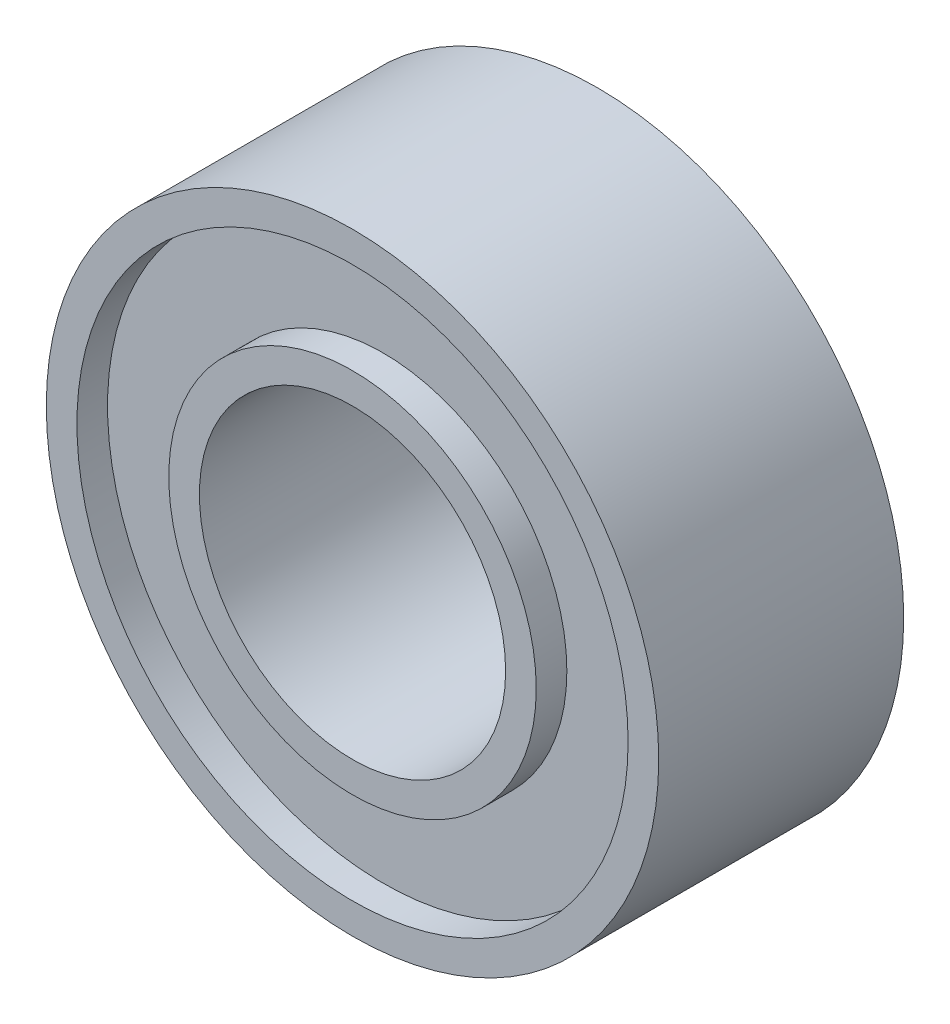
ISO-10303-21;
HEADER;
FILE_DESCRIPTION(('STEP AP214'),'2;1');
FILE_NAME('part.step','',(''),(''),'','','');
FILE_SCHEMA(('AUTOMOTIVE_DESIGN { 1 0 10303 214 1 1 1 1 }'));
ENDSEC;
DATA;
#1=APPLICATION_CONTEXT('core data for automotive mechanical design processes');
#2=APPLICATION_PROTOCOL_DEFINITION('international standard','automotive_design',2000,#1);
#3=PRODUCT_CONTEXT('',#1,'mechanical');
#4=PRODUCT('Part','Part','',(#3));
#5=PRODUCT_RELATED_PRODUCT_CATEGORY('part','',(#4));
#6=PRODUCT_DEFINITION_FORMATION('','',#4);
#7=PRODUCT_DEFINITION_CONTEXT('part definition',#1,'design');
#8=PRODUCT_DEFINITION('design','',#6,#7);
#9=PRODUCT_DEFINITION_SHAPE('','',#8);
#10=(LENGTH_UNIT() NAMED_UNIT(*) SI_UNIT(.MILLI.,.METRE.));
#11=(NAMED_UNIT(*) PLANE_ANGLE_UNIT() SI_UNIT($,.RADIAN.));
#12=(NAMED_UNIT(*) SI_UNIT($,.STERADIAN.) SOLID_ANGLE_UNIT());
#13=UNCERTAINTY_MEASURE_WITH_UNIT(LENGTH_MEASURE(1.E-05),#10,'distance_accuracy_value','');
#14=(GEOMETRIC_REPRESENTATION_CONTEXT(3) GLOBAL_UNCERTAINTY_ASSIGNED_CONTEXT((#13)) GLOBAL_UNIT_ASSIGNED_CONTEXT((#10,
#11,#12)) REPRESENTATION_CONTEXT('',''));
#15=CARTESIAN_POINT('',(0.,0.,0.));
#16=DIRECTION('',(0.,0.,1.));
#17=DIRECTION('',(1.,0.,0.));
#18=AXIS2_PLACEMENT_3D('',#15,#16,#17);
#19=CARTESIAN_POINT('',(0.,0.,0.));
#20=DIRECTION('',(0.,0.,1.));
#21=DIRECTION('',(1.,0.,0.));
#22=AXIS2_PLACEMENT_3D('',#19,#20,#21);
#23=PLANE('',#22);
#24=CARTESIAN_POINT('',(0.,0.,0.));
#25=DIRECTION('',(0.,0.,1.));
#26=DIRECTION('',(1.,0.,0.));
#27=AXIS2_PLACEMENT_3D('',#24,#25,#26);
#28=CIRCLE('',#27,2.5);
#29=CARTESIAN_POINT('',(2.5,0.,0.));
#30=VERTEX_POINT('',#29);
#31=EDGE_CURVE('E52',#30,#30,#28,.T.);
#32=ORIENTED_EDGE('',*,*,#31,.T.);
#33=EDGE_LOOP('',(#32));
#34=FACE_BOUND('',#33,.T.);
#35=CARTESIAN_POINT('',(0.,0.,0.));
#36=DIRECTION('',(0.,0.,1.));
#37=DIRECTION('',(1.,0.,0.));
#38=AXIS2_PLACEMENT_3D('',#35,#36,#37);
#39=CIRCLE('',#38,3.);
#40=CARTESIAN_POINT('',(3.,0.,0.));
#41=VERTEX_POINT('',#40);
#42=EDGE_CURVE('E84',#41,#41,#39,.T.);
#43=ORIENTED_EDGE('',*,*,#42,.F.);
#44=EDGE_LOOP('',(#43));
#45=FACE_BOUND('',#44,.T.);
#46=ADVANCED_FACE('F37',(#34,#45),#23,.F.);
#47=CARTESIAN_POINT('',(0.,0.,4.));
#48=DIRECTION('',(0.,0.,1.));
#49=DIRECTION('',(1.,0.,0.));
#50=AXIS2_PLACEMENT_3D('',#47,#48,#49);
#51=PLANE('',#50);
#52=CARTESIAN_POINT('',(0.,0.,4.));
#53=DIRECTION('',(0.,0.,1.));
#54=DIRECTION('',(1.,0.,0.));
#55=AXIS2_PLACEMENT_3D('',#52,#53,#54);
#56=CIRCLE('',#55,2.5);
#57=CARTESIAN_POINT('',(2.5,0.,4.));
#58=VERTEX_POINT('',#57);
#59=EDGE_CURVE('E50',#58,#58,#56,.T.);
#60=ORIENTED_EDGE('',*,*,#59,.F.);
#61=EDGE_LOOP('',(#60));
#62=FACE_BOUND('',#61,.T.);
#63=CARTESIAN_POINT('',(0.,0.,4.));
#64=DIRECTION('',(0.,0.,1.));
#65=DIRECTION('',(1.,0.,0.));
#66=AXIS2_PLACEMENT_3D('',#63,#64,#65);
#67=CIRCLE('',#66,3.);
#68=CARTESIAN_POINT('',(3.,0.,4.));
#69=VERTEX_POINT('',#68);
#70=EDGE_CURVE('E68',#69,#69,#67,.T.);
#71=ORIENTED_EDGE('',*,*,#70,.T.);
#72=EDGE_LOOP('',(#71));
#73=FACE_BOUND('',#72,.T.);
#74=ADVANCED_FACE('F102',(#62,#73),#51,.T.);
#75=CARTESIAN_POINT('',(0.,0.,4.));
#76=DIRECTION('',(0.,0.,1.));
#77=DIRECTION('',(1.,0.,0.));
#78=AXIS2_PLACEMENT_3D('',#75,#76,#77);
#79=CIRCLE('',#78,4.5);
#80=CARTESIAN_POINT('',(4.5,0.,4.));
#81=VERTEX_POINT('',#80);
#82=EDGE_CURVE('E60',#81,#81,#79,.T.);
#83=ORIENTED_EDGE('',*,*,#82,.F.);
#84=EDGE_LOOP('',(#83));
#85=FACE_BOUND('',#84,.T.);
#86=CARTESIAN_POINT('',(0.,0.,4.));
#87=DIRECTION('',(0.,0.,1.));
#88=DIRECTION('',(1.,0.,0.));
#89=AXIS2_PLACEMENT_3D('',#86,#87,#88);
#90=CIRCLE('',#89,5.);
#91=CARTESIAN_POINT('',(5.,0.,4.));
#92=VERTEX_POINT('',#91);
#93=EDGE_CURVE('E10',#92,#92,#90,.T.);
#94=ORIENTED_EDGE('',*,*,#93,.T.);
#95=EDGE_LOOP('',(#94));
#96=FACE_BOUND('',#95,.T.);
#97=ADVANCED_FACE('F108',(#85,#96),#51,.T.);
#98=CARTESIAN_POINT('',(0.,0.,0.));
#99=DIRECTION('',(0.,0.,1.));
#100=DIRECTION('',(1.,0.,0.));
#101=AXIS2_PLACEMENT_3D('',#98,#99,#100);
#102=CIRCLE('',#101,4.5);
#103=CARTESIAN_POINT('',(4.5,0.,0.));
#104=VERTEX_POINT('',#103);
#105=EDGE_CURVE('E76',#104,#104,#102,.T.);
#106=ORIENTED_EDGE('',*,*,#105,.T.);
#107=EDGE_LOOP('',(#106));
#108=FACE_BOUND('',#107,.T.);
#109=CARTESIAN_POINT('',(0.,0.,0.));
#110=DIRECTION('',(0.,0.,1.));
#111=DIRECTION('',(1.,0.,0.));
#112=AXIS2_PLACEMENT_3D('',#109,#110,#111);
#113=CIRCLE('',#112,5.);
#114=CARTESIAN_POINT('',(5.,0.,0.));
#115=VERTEX_POINT('',#114);
#116=EDGE_CURVE('E41',#115,#115,#113,.T.);
#117=ORIENTED_EDGE('',*,*,#116,.F.);
#118=EDGE_LOOP('',(#117));
#119=FACE_BOUND('',#118,.T.);
#120=ADVANCED_FACE('F104',(#108,#119),#23,.F.);
#121=CARTESIAN_POINT('',(0.,0.,4.));
#122=DIRECTION('',(0.,0.,-1.));
#123=DIRECTION('',(-1.,0.,0.));
#124=AXIS2_PLACEMENT_3D('',#121,#122,#123);
#125=CYLINDRICAL_SURFACE('',#124,5.);
#126=ORIENTED_EDGE('',*,*,#93,.F.);
#127=EDGE_LOOP('',(#126));
#128=FACE_BOUND('',#127,.T.);
#129=ORIENTED_EDGE('',*,*,#116,.T.);
#130=EDGE_LOOP('',(#129));
#131=FACE_BOUND('',#130,.T.);
#132=ADVANCED_FACE('F39',(#128,#131),#125,.T.);
#133=CARTESIAN_POINT('',(0.,0.,4.));
#134=DIRECTION('',(0.,0.,-1.));
#135=DIRECTION('',(-1.,0.,0.));
#136=AXIS2_PLACEMENT_3D('',#133,#134,#135);
#137=CYLINDRICAL_SURFACE('',#136,2.5);
#138=ORIENTED_EDGE('',*,*,#59,.T.);
#139=EDGE_LOOP('',(#138));
#140=FACE_BOUND('',#139,.T.);
#141=ORIENTED_EDGE('',*,*,#31,.F.);
#142=EDGE_LOOP('',(#141));
#143=FACE_BOUND('',#142,.T.);
#144=ADVANCED_FACE('F117',(#140,#143),#137,.F.);
#145=CARTESIAN_POINT('',(0.,0.,3.5));
#146=DIRECTION('',(0.,0.,1.));
#147=DIRECTION('',(1.,0.,0.));
#148=AXIS2_PLACEMENT_3D('',#145,#146,#147);
#149=CYLINDRICAL_SURFACE('',#148,4.5);
#150=CARTESIAN_POINT('',(0.,0.,3.5));
#151=DIRECTION('',(0.,0.,1.));
#152=DIRECTION('',(1.,0.,0.));
#153=AXIS2_PLACEMENT_3D('',#150,#151,#152);
#154=CIRCLE('',#153,4.5);
#155=CARTESIAN_POINT('',(4.5,0.,3.5));
#156=VERTEX_POINT('',#155);
#157=EDGE_CURVE('E56',#156,#156,#154,.T.);
#158=ORIENTED_EDGE('',*,*,#157,.F.);
#159=EDGE_LOOP('',(#158));
#160=FACE_BOUND('',#159,.T.);
#161=ORIENTED_EDGE('',*,*,#82,.T.);
#162=EDGE_LOOP('',(#161));
#163=FACE_BOUND('',#162,.T.);
#164=ADVANCED_FACE('F141',(#160,#163),#149,.F.);
#165=CARTESIAN_POINT('',(0.,0.,3.5));
#166=DIRECTION('',(0.,0.,1.));
#167=DIRECTION('',(1.,0.,0.));
#168=AXIS2_PLACEMENT_3D('',#165,#166,#167);
#169=PLANE('',#168);
#170=CARTESIAN_POINT('',(0.,0.,3.5));
#171=DIRECTION('',(0.,0.,1.));
#172=DIRECTION('',(1.,0.,0.));
#173=AXIS2_PLACEMENT_3D('',#170,#171,#172);
#174=CIRCLE('',#173,3.);
#175=CARTESIAN_POINT('',(3.,0.,3.5));
#176=VERTEX_POINT('',#175);
#177=EDGE_CURVE('E64',#176,#176,#174,.T.);
#178=ORIENTED_EDGE('',*,*,#177,.F.);
#179=EDGE_LOOP('',(#178));
#180=FACE_BOUND('',#179,.T.);
#181=ORIENTED_EDGE('',*,*,#157,.T.);
#182=EDGE_LOOP('',(#181));
#183=FACE_BOUND('',#182,.T.);
#184=ADVANCED_FACE('F137',(#180,#183),#169,.T.);
#185=CARTESIAN_POINT('',(0.,0.,3.5));
#186=DIRECTION('',(0.,0.,1.));
#187=DIRECTION('',(1.,0.,0.));
#188=AXIS2_PLACEMENT_3D('',#185,#186,#187);
#189=CYLINDRICAL_SURFACE('',#188,3.);
#190=ORIENTED_EDGE('',*,*,#177,.T.);
#191=EDGE_LOOP('',(#190));
#192=FACE_BOUND('',#191,.T.);
#193=ORIENTED_EDGE('',*,*,#70,.F.);
#194=EDGE_LOOP('',(#193));
#195=FACE_BOUND('',#194,.T.);
#196=ADVANCED_FACE('F131',(#192,#195),#189,.T.);
#197=CARTESIAN_POINT('',(0.,0.,0.5));
#198=DIRECTION('',(0.,0.,1.));
#199=DIRECTION('',(1.,0.,0.));
#200=AXIS2_PLACEMENT_3D('',#197,#198,#199);
#201=PLANE('',#200);
#202=CARTESIAN_POINT('',(0.,0.,0.5));
#203=DIRECTION('',(0.,0.,1.));
#204=DIRECTION('',(1.,0.,0.));
#205=AXIS2_PLACEMENT_3D('',#202,#203,#204);
#206=CIRCLE('',#205,4.5);
#207=CARTESIAN_POINT('',(4.5,0.,0.5));
#208=VERTEX_POINT('',#207);
#209=EDGE_CURVE('E72',#208,#208,#206,.T.);
#210=ORIENTED_EDGE('',*,*,#209,.F.);
#211=EDGE_LOOP('',(#210));
#212=FACE_BOUND('',#211,.T.);
#213=CARTESIAN_POINT('',(0.,0.,0.5));
#214=DIRECTION('',(0.,0.,1.));
#215=DIRECTION('',(1.,0.,0.));
#216=AXIS2_PLACEMENT_3D('',#213,#214,#215);
#217=CIRCLE('',#216,3.);
#218=CARTESIAN_POINT('',(3.,0.,0.5));
#219=VERTEX_POINT('',#218);
#220=EDGE_CURVE('E80',#219,#219,#217,.T.);
#221=ORIENTED_EDGE('',*,*,#220,.T.);
#222=EDGE_LOOP('',(#221));
#223=FACE_BOUND('',#222,.T.);
#224=ADVANCED_FACE('F92',(#212,#223),#201,.F.);
#225=CARTESIAN_POINT('',(0.,0.,0.5));
#226=DIRECTION('',(0.,0.,-1.));
#227=DIRECTION('',(-1.,0.,0.));
#228=AXIS2_PLACEMENT_3D('',#225,#226,#227);
#229=CYLINDRICAL_SURFACE('',#228,4.5);
#230=ORIENTED_EDGE('',*,*,#209,.T.);
#231=EDGE_LOOP('',(#230));
#232=FACE_BOUND('',#231,.T.);
#233=ORIENTED_EDGE('',*,*,#105,.F.);
#234=EDGE_LOOP('',(#233));
#235=FACE_BOUND('',#234,.T.);
#236=ADVANCED_FACE('F97',(#232,#235),#229,.F.);
#237=CARTESIAN_POINT('',(0.,0.,0.5));
#238=DIRECTION('',(0.,0.,-1.));
#239=DIRECTION('',(-1.,0.,0.));
#240=AXIS2_PLACEMENT_3D('',#237,#238,#239);
#241=CYLINDRICAL_SURFACE('',#240,3.);
#242=ORIENTED_EDGE('',*,*,#220,.F.);
#243=EDGE_LOOP('',(#242));
#244=FACE_BOUND('',#243,.T.);
#245=ORIENTED_EDGE('',*,*,#42,.T.);
#246=EDGE_LOOP('',(#245));
#247=FACE_BOUND('',#246,.T.);
#248=ADVANCED_FACE('F94',(#244,#247),#241,.T.);
#249=CLOSED_SHELL('',(#46,#74,#97,#120,#132,#144,#164,#184,#196,#224,#236,#248));
#250=MANIFOLD_SOLID_BREP('B2',#249);
#251=ADVANCED_BREP_SHAPE_REPRESENTATION('',(#18,#250),#14);
#252=SHAPE_DEFINITION_REPRESENTATION(#9,#251);
ENDSEC;
END-ISO-10303-21;
